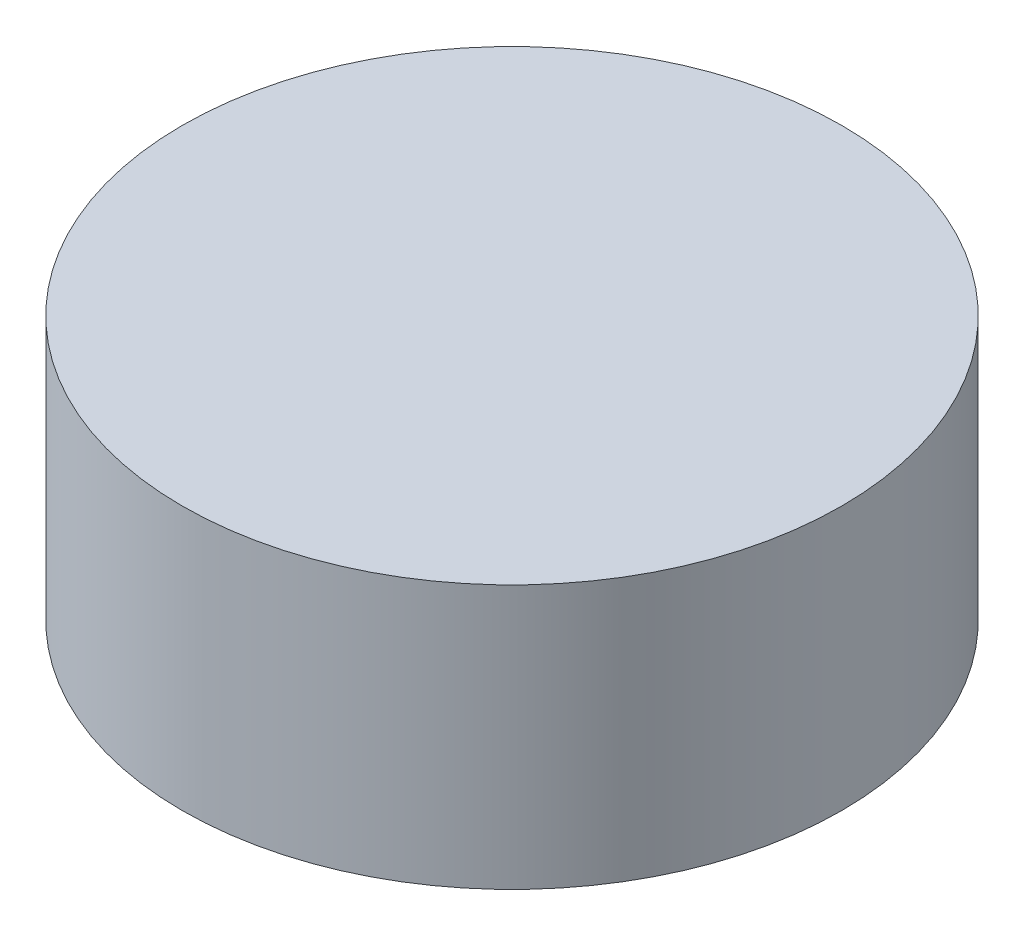
ISO-10303-21;
HEADER;
FILE_DESCRIPTION(('STEP AP214'),'2;1');
FILE_NAME('part.step','',(''),(''),'','','');
FILE_SCHEMA(('AUTOMOTIVE_DESIGN { 1 0 10303 214 1 1 1 1 }'));
ENDSEC;
DATA;
#1=APPLICATION_CONTEXT('core data for automotive mechanical design processes');
#2=APPLICATION_PROTOCOL_DEFINITION('international standard','automotive_design',2000,#1);
#3=PRODUCT_CONTEXT('',#1,'mechanical');
#4=PRODUCT('Part','Part','',(#3));
#5=PRODUCT_RELATED_PRODUCT_CATEGORY('part','',(#4));
#6=PRODUCT_DEFINITION_FORMATION('','',#4);
#7=PRODUCT_DEFINITION_CONTEXT('part definition',#1,'design');
#8=PRODUCT_DEFINITION('design','',#6,#7);
#9=PRODUCT_DEFINITION_SHAPE('','',#8);
#10=(LENGTH_UNIT() NAMED_UNIT(*) SI_UNIT(.MILLI.,.METRE.));
#11=(NAMED_UNIT(*) PLANE_ANGLE_UNIT() SI_UNIT($,.RADIAN.));
#12=(NAMED_UNIT(*) SI_UNIT($,.STERADIAN.) SOLID_ANGLE_UNIT());
#13=UNCERTAINTY_MEASURE_WITH_UNIT(LENGTH_MEASURE(1.E-05),#10,'distance_accuracy_value','');
#14=(GEOMETRIC_REPRESENTATION_CONTEXT(3) GLOBAL_UNCERTAINTY_ASSIGNED_CONTEXT((#13)) GLOBAL_UNIT_ASSIGNED_CONTEXT((#10,
#11,#12)) REPRESENTATION_CONTEXT('',''));
#15=CARTESIAN_POINT('',(0.,0.,0.));
#16=DIRECTION('',(0.,0.,1.));
#17=DIRECTION('',(1.,0.,0.));
#18=AXIS2_PLACEMENT_3D('',#15,#16,#17);
#19=CARTESIAN_POINT('',(0.,10.,0.));
#20=DIRECTION('',(0.,-1.,0.));
#21=DIRECTION('',(0.,0.,-1.));
#22=AXIS2_PLACEMENT_3D('',#19,#20,#21);
#23=CYLINDRICAL_SURFACE('',#22,25.);
#24=CARTESIAN_POINT('',(0.,10.,0.));
#25=DIRECTION('',(0.,1.,0.));
#26=DIRECTION('',(0.,0.,1.));
#27=AXIS2_PLACEMENT_3D('',#24,#25,#26);
#28=CIRCLE('',#27,25.);
#29=CARTESIAN_POINT('',(0.,10.,25.));
#30=VERTEX_POINT('',#29);
#31=EDGE_CURVE('E10',#30,#30,#28,.T.);
#32=ORIENTED_EDGE('',*,*,#31,.F.);
#33=EDGE_LOOP('',(#32));
#34=FACE_BOUND('',#33,.T.);
#35=CARTESIAN_POINT('',(0.,-10.,0.));
#36=DIRECTION('',(0.,1.,0.));
#37=DIRECTION('',(0.,0.,1.));
#38=AXIS2_PLACEMENT_3D('',#35,#36,#37);
#39=CIRCLE('',#38,25.);
#40=CARTESIAN_POINT('',(0.,-10.,25.));
#41=VERTEX_POINT('',#40);
#42=EDGE_CURVE('E40',#41,#41,#39,.T.);
#43=ORIENTED_EDGE('',*,*,#42,.T.);
#44=EDGE_LOOP('',(#43));
#45=FACE_BOUND('',#44,.T.);
#46=ADVANCED_FACE('F37',(#34,#45),#23,.T.);
#47=CARTESIAN_POINT('',(0.,10.,0.));
#48=DIRECTION('',(0.,1.,0.));
#49=DIRECTION('',(0.,0.,1.));
#50=AXIS2_PLACEMENT_3D('',#47,#48,#49);
#51=PLANE('',#50);
#52=ORIENTED_EDGE('',*,*,#31,.T.);
#53=EDGE_LOOP('',(#52));
#54=FACE_BOUND('',#53,.T.);
#55=ADVANCED_FACE('F54',(#54),#51,.T.);
#56=CARTESIAN_POINT('',(0.,-10.,0.));
#57=DIRECTION('',(0.,1.,0.));
#58=DIRECTION('',(0.,0.,1.));
#59=AXIS2_PLACEMENT_3D('',#56,#57,#58);
#60=PLANE('',#59);
#61=ORIENTED_EDGE('',*,*,#42,.F.);
#62=EDGE_LOOP('',(#61));
#63=FACE_BOUND('',#62,.T.);
#64=ADVANCED_FACE('F52',(#63),#60,.F.);
#65=CLOSED_SHELL('',(#46,#55,#64));
#66=MANIFOLD_SOLID_BREP('B2',#65);
#67=ADVANCED_BREP_SHAPE_REPRESENTATION('',(#18,#66),#14);
#68=SHAPE_DEFINITION_REPRESENTATION(#9,#67);
ENDSEC;
END-ISO-10303-21;
